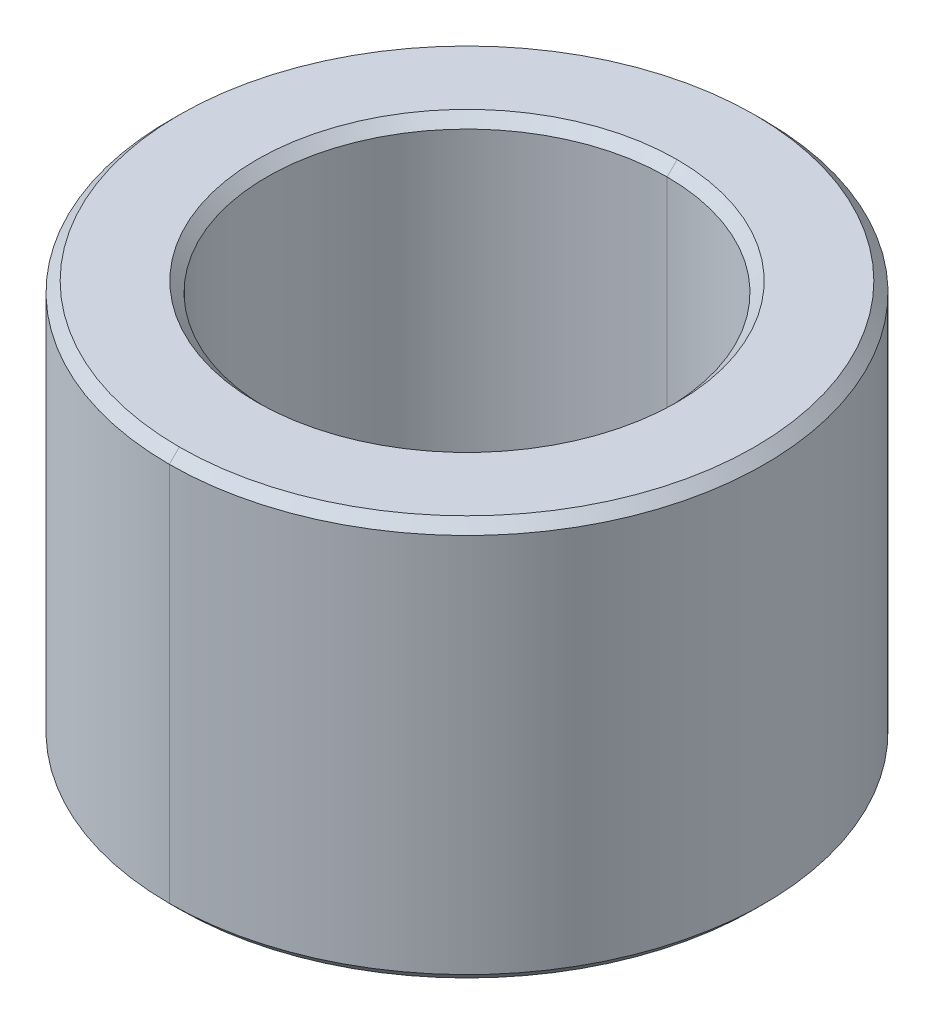
ISO-10303-21;
HEADER;
FILE_DESCRIPTION(('STEP AP214'),'2;1');
FILE_NAME('part.step','',(''),(''),'','','');
FILE_SCHEMA(('AUTOMOTIVE_DESIGN { 1 0 10303 214 1 1 1 1 }'));
ENDSEC;
DATA;
#1=APPLICATION_CONTEXT('core data for automotive mechanical design processes');
#2=APPLICATION_PROTOCOL_DEFINITION('international standard','automotive_design',2000,#1);
#3=PRODUCT_CONTEXT('',#1,'mechanical');
#4=PRODUCT('Part','Part','',(#3));
#5=PRODUCT_RELATED_PRODUCT_CATEGORY('part','',(#4));
#6=PRODUCT_DEFINITION_FORMATION('','',#4);
#7=PRODUCT_DEFINITION_CONTEXT('part definition',#1,'design');
#8=PRODUCT_DEFINITION('design','',#6,#7);
#9=PRODUCT_DEFINITION_SHAPE('','',#8);
#10=(LENGTH_UNIT() NAMED_UNIT(*) SI_UNIT(.MILLI.,.METRE.));
#11=(NAMED_UNIT(*) PLANE_ANGLE_UNIT() SI_UNIT($,.RADIAN.));
#12=(NAMED_UNIT(*) SI_UNIT($,.STERADIAN.) SOLID_ANGLE_UNIT());
#13=UNCERTAINTY_MEASURE_WITH_UNIT(LENGTH_MEASURE(1.E-05),#10,'distance_accuracy_value','');
#14=(GEOMETRIC_REPRESENTATION_CONTEXT(3) GLOBAL_UNCERTAINTY_ASSIGNED_CONTEXT((#13)) GLOBAL_UNIT_ASSIGNED_CONTEXT((#10,
#11,#12)) REPRESENTATION_CONTEXT('',''));
#15=CARTESIAN_POINT('',(0.,0.,0.));
#16=DIRECTION('',(0.,0.,1.));
#17=DIRECTION('',(1.,0.,0.));
#18=AXIS2_PLACEMENT_3D('',#15,#16,#17);
#19=CARTESIAN_POINT('',(0.,1.9,0.));
#20=DIRECTION('',(0.,1.,0.));
#21=DIRECTION('',(0.,0.,1.));
#22=AXIS2_PLACEMENT_3D('',#19,#20,#21);
#23=CONICAL_SURFACE('',#22,2.,0.785398163397455);
#24=DIRECTION('',(0.,0.707106781186543,-0.707106781186552));
#25=VECTOR('',#24,1.);
#26=CARTESIAN_POINT('',(0.,1.9,-2.));
#27=LINE('',#26,#25);
#28=CARTESIAN_POINT('',(0.,1.9,-2.));
#29=VERTEX_POINT('',#28);
#30=CARTESIAN_POINT('',(0.,2.,-2.1));
#31=VERTEX_POINT('',#30);
#32=EDGE_CURVE('E103',#29,#31,#27,.T.);
#33=ORIENTED_EDGE('',*,*,#32,.F.);
#34=CARTESIAN_POINT('',(0.,1.9,0.));
#35=DIRECTION('',(0.,1.,0.));
#36=DIRECTION('',(0.,0.,1.));
#37=AXIS2_PLACEMENT_3D('',#34,#35,#36);
#38=CIRCLE('',#37,2.);
#39=CARTESIAN_POINT('',(0.,1.9,2.));
#40=VERTEX_POINT('',#39);
#41=EDGE_CURVE('E26',#40,#29,#38,.T.);
#42=ORIENTED_EDGE('',*,*,#41,.F.);
#43=DIRECTION('',(0.,0.707106781186543,0.707106781186552));
#44=VECTOR('',#43,1.);
#45=CARTESIAN_POINT('',(0.,1.9,2.));
#46=LINE('',#45,#44);
#47=CARTESIAN_POINT('',(0.,2.,2.1));
#48=VERTEX_POINT('',#47);
#49=EDGE_CURVE('E100',#40,#48,#46,.T.);
#50=ORIENTED_EDGE('',*,*,#49,.T.);
#51=CARTESIAN_POINT('',(0.,2.,0.));
#52=DIRECTION('',(0.,-1.,0.));
#53=DIRECTION('',(0.,0.,1.));
#54=AXIS2_PLACEMENT_3D('',#51,#52,#53);
#55=CIRCLE('',#54,2.1);
#56=EDGE_CURVE('E188',#31,#48,#55,.T.);
#57=ORIENTED_EDGE('',*,*,#56,.F.);
#58=EDGE_LOOP('',(#33,#42,#50,#57));
#59=FACE_BOUND('',#58,.T.);
#60=ADVANCED_FACE('F15',(#59),#23,.F.);
#61=CARTESIAN_POINT('',(0.,-2.,0.));
#62=DIRECTION('',(0.,-1.,0.));
#63=DIRECTION('',(0.,0.,-1.));
#64=AXIS2_PLACEMENT_3D('',#61,#62,#63);
#65=CONICAL_SURFACE('',#64,2.1,0.785398163397443);
#66=DIRECTION('',(0.,-0.707106781186551,0.707106781186545));
#67=VECTOR('',#66,1.);
#68=CARTESIAN_POINT('',(0.,-2.,2.1));
#69=LINE('',#68,#67);
#70=CARTESIAN_POINT('',(0.,-1.9,2.));
#71=VERTEX_POINT('',#70);
#72=CARTESIAN_POINT('',(0.,-2.,2.1));
#73=VERTEX_POINT('',#72);
#74=EDGE_CURVE('E145',#71,#73,#69,.T.);
#75=ORIENTED_EDGE('',*,*,#74,.F.);
#76=CARTESIAN_POINT('',(0.,-1.9,0.));
#77=DIRECTION('',(0.,-1.,0.));
#78=DIRECTION('',(0.,0.,1.));
#79=AXIS2_PLACEMENT_3D('',#76,#77,#78);
#80=CIRCLE('',#79,2.);
#81=CARTESIAN_POINT('',(0.,-1.9,-2.));
#82=VERTEX_POINT('',#81);
#83=EDGE_CURVE('E10',#82,#71,#80,.T.);
#84=ORIENTED_EDGE('',*,*,#83,.F.);
#85=DIRECTION('',(0.,-0.707106781186551,-0.707106781186545));
#86=VECTOR('',#85,1.);
#87=CARTESIAN_POINT('',(0.,-2.,-2.1));
#88=LINE('',#87,#86);
#89=CARTESIAN_POINT('',(0.,-2.,-2.1));
#90=VERTEX_POINT('',#89);
#91=EDGE_CURVE('E144',#82,#90,#88,.T.);
#92=ORIENTED_EDGE('',*,*,#91,.T.);
#93=CARTESIAN_POINT('',(0.,-2.,0.));
#94=DIRECTION('',(0.,1.,0.));
#95=DIRECTION('',(0.,0.,1.));
#96=AXIS2_PLACEMENT_3D('',#93,#94,#95);
#97=CIRCLE('',#96,2.1);
#98=EDGE_CURVE('E149',#73,#90,#97,.T.);
#99=ORIENTED_EDGE('',*,*,#98,.F.);
#100=EDGE_LOOP('',(#75,#84,#92,#99));
#101=FACE_BOUND('',#100,.T.);
#102=ADVANCED_FACE('F276',(#101),#65,.F.);
#103=CARTESIAN_POINT('',(0.,2.,0.));
#104=DIRECTION('',(0.,-1.,0.));
#105=DIRECTION('',(0.,0.,-1.));
#106=AXIS2_PLACEMENT_3D('',#103,#104,#105);
#107=CONICAL_SURFACE('',#106,2.875,0.785398163397452);
#108=DIRECTION('',(0.,-0.707106781186545,0.707106781186551));
#109=VECTOR('',#108,1.);
#110=CARTESIAN_POINT('',(0.,2.,2.875));
#111=LINE('',#110,#109);
#112=CARTESIAN_POINT('',(0.,2.,2.875));
#113=VERTEX_POINT('',#112);
#114=CARTESIAN_POINT('',(0.,1.9,2.975));
#115=VERTEX_POINT('',#114);
#116=EDGE_CURVE('E154',#113,#115,#111,.T.);
#117=ORIENTED_EDGE('',*,*,#116,.F.);
#118=CARTESIAN_POINT('',(0.,2.,0.));
#119=DIRECTION('',(0.,1.,0.));
#120=DIRECTION('',(0.,0.,1.));
#121=AXIS2_PLACEMENT_3D('',#118,#119,#120);
#122=CIRCLE('',#121,2.875);
#123=CARTESIAN_POINT('',(0.,2.,-2.875));
#124=VERTEX_POINT('',#123);
#125=EDGE_CURVE('E19',#124,#113,#122,.T.);
#126=ORIENTED_EDGE('',*,*,#125,.F.);
#127=DIRECTION('',(0.,-0.707106781186545,-0.707106781186551));
#128=VECTOR('',#127,1.);
#129=CARTESIAN_POINT('',(0.,2.,-2.875));
#130=LINE('',#129,#128);
#131=CARTESIAN_POINT('',(0.,1.9,-2.975));
#132=VERTEX_POINT('',#131);
#133=EDGE_CURVE('E153',#124,#132,#130,.T.);
#134=ORIENTED_EDGE('',*,*,#133,.T.);
#135=CARTESIAN_POINT('',(0.,1.9,0.));
#136=DIRECTION('',(0.,-1.,0.));
#137=DIRECTION('',(0.,0.,1.));
#138=AXIS2_PLACEMENT_3D('',#135,#136,#137);
#139=CIRCLE('',#138,2.975);
#140=EDGE_CURVE('E146',#115,#132,#139,.T.);
#141=ORIENTED_EDGE('',*,*,#140,.F.);
#142=EDGE_LOOP('',(#117,#126,#134,#141));
#143=FACE_BOUND('',#142,.T.);
#144=ADVANCED_FACE('F17',(#143),#107,.T.);
#145=CARTESIAN_POINT('',(0.,-1.9,0.));
#146=DIRECTION('',(0.,1.,0.));
#147=DIRECTION('',(0.,0.,1.));
#148=AXIS2_PLACEMENT_3D('',#145,#146,#147);
#149=CONICAL_SURFACE('',#148,2.975,0.78539816339745);
#150=DIRECTION('',(0.,0.707106781186546,-0.707106781186549));
#151=VECTOR('',#150,1.);
#152=CARTESIAN_POINT('',(0.,-1.9,-2.975));
#153=LINE('',#152,#151);
#154=CARTESIAN_POINT('',(0.,-2.,-2.875));
#155=VERTEX_POINT('',#154);
#156=CARTESIAN_POINT('',(0.,-1.9,-2.975));
#157=VERTEX_POINT('',#156);
#158=EDGE_CURVE('E172',#155,#157,#153,.T.);
#159=ORIENTED_EDGE('',*,*,#158,.F.);
#160=CARTESIAN_POINT('',(0.,-2.,0.));
#161=DIRECTION('',(0.,-1.,0.));
#162=DIRECTION('',(0.,0.,1.));
#163=AXIS2_PLACEMENT_3D('',#160,#161,#162);
#164=CIRCLE('',#163,2.875);
#165=CARTESIAN_POINT('',(0.,-2.,2.875));
#166=VERTEX_POINT('',#165);
#167=EDGE_CURVE('E185',#166,#155,#164,.T.);
#168=ORIENTED_EDGE('',*,*,#167,.F.);
#169=DIRECTION('',(0.,0.707106781186546,0.707106781186549));
#170=VECTOR('',#169,1.);
#171=CARTESIAN_POINT('',(0.,-1.9,2.975));
#172=LINE('',#171,#170);
#173=CARTESIAN_POINT('',(0.,-1.9,2.975));
#174=VERTEX_POINT('',#173);
#175=EDGE_CURVE('E119',#166,#174,#172,.T.);
#176=ORIENTED_EDGE('',*,*,#175,.T.);
#177=CARTESIAN_POINT('',(0.,-1.9,0.));
#178=DIRECTION('',(0.,1.,0.));
#179=DIRECTION('',(0.,0.,1.));
#180=AXIS2_PLACEMENT_3D('',#177,#178,#179);
#181=CIRCLE('',#180,2.975);
#182=EDGE_CURVE('E41',#157,#174,#181,.T.);
#183=ORIENTED_EDGE('',*,*,#182,.F.);
#184=EDGE_LOOP('',(#159,#168,#176,#183));
#185=FACE_BOUND('',#184,.T.);
#186=ADVANCED_FACE('F291',(#185),#149,.T.);
#187=CARTESIAN_POINT('',(0.,2.,0.));
#188=DIRECTION('',(0.,-1.,0.));
#189=DIRECTION('',(0.,0.,-1.));
#190=AXIS2_PLACEMENT_3D('',#187,#188,#189);
#191=CYLINDRICAL_SURFACE('',#190,2.);
#192=DIRECTION('',(0.,-1.,0.));
#193=VECTOR('',#192,1.);
#194=CARTESIAN_POINT('',(0.,2.,2.));
#195=LINE('',#194,#193);
#196=EDGE_CURVE('E111',#40,#71,#195,.T.);
#197=ORIENTED_EDGE('',*,*,#196,.F.);
#198=ORIENTED_EDGE('',*,*,#41,.T.);
#199=DIRECTION('',(0.,-1.,0.));
#200=VECTOR('',#199,1.);
#201=CARTESIAN_POINT('',(0.,2.,-2.));
#202=LINE('',#201,#200);
#203=EDGE_CURVE('E118',#29,#82,#202,.T.);
#204=ORIENTED_EDGE('',*,*,#203,.T.);
#205=ORIENTED_EDGE('',*,*,#83,.T.);
#206=EDGE_LOOP('',(#197,#198,#204,#205));
#207=FACE_BOUND('',#206,.T.);
#208=ADVANCED_FACE('F112',(#207),#191,.F.);
#209=CARTESIAN_POINT('',(0.,2.,0.));
#210=DIRECTION('',(0.,-1.,0.));
#211=DIRECTION('',(0.,0.,-1.));
#212=AXIS2_PLACEMENT_3D('',#209,#210,#211);
#213=CYLINDRICAL_SURFACE('',#212,2.975);
#214=DIRECTION('',(0.,-1.,0.));
#215=VECTOR('',#214,1.);
#216=CARTESIAN_POINT('',(0.,2.,2.975));
#217=LINE('',#216,#215);
#218=EDGE_CURVE('E182',#115,#174,#217,.T.);
#219=ORIENTED_EDGE('',*,*,#218,.F.);
#220=ORIENTED_EDGE('',*,*,#140,.T.);
#221=DIRECTION('',(0.,-1.,0.));
#222=VECTOR('',#221,1.);
#223=CARTESIAN_POINT('',(0.,2.,-2.975));
#224=LINE('',#223,#222);
#225=EDGE_CURVE('E169',#132,#157,#224,.T.);
#226=ORIENTED_EDGE('',*,*,#225,.T.);
#227=ORIENTED_EDGE('',*,*,#182,.T.);
#228=EDGE_LOOP('',(#219,#220,#226,#227));
#229=FACE_BOUND('',#228,.T.);
#230=ADVANCED_FACE('F285',(#229),#213,.T.);
#231=CARTESIAN_POINT('',(0.,-2.,0.));
#232=DIRECTION('',(0.,1.,0.));
#233=DIRECTION('',(1.,0.,0.));
#234=AXIS2_PLACEMENT_3D('',#231,#232,#233);
#235=PLANE('',#234);
#236=CARTESIAN_POINT('',(0.,-2.,0.));
#237=DIRECTION('',(0.,1.,0.));
#238=DIRECTION('',(0.,0.,1.));
#239=AXIS2_PLACEMENT_3D('',#236,#237,#238);
#240=CIRCLE('',#239,2.1);
#241=EDGE_CURVE('E140',#90,#73,#240,.T.);
#242=ORIENTED_EDGE('',*,*,#241,.T.);
#243=ORIENTED_EDGE('',*,*,#98,.T.);
#244=EDGE_LOOP('',(#242,#243));
#245=FACE_BOUND('',#244,.T.);
#246=ORIENTED_EDGE('',*,*,#167,.T.);
#247=CARTESIAN_POINT('',(0.,-2.,0.));
#248=DIRECTION('',(0.,-1.,0.));
#249=DIRECTION('',(0.,0.,1.));
#250=AXIS2_PLACEMENT_3D('',#247,#248,#249);
#251=CIRCLE('',#250,2.875);
#252=EDGE_CURVE('E177',#155,#166,#251,.T.);
#253=ORIENTED_EDGE('',*,*,#252,.T.);
#254=EDGE_LOOP('',(#246,#253));
#255=FACE_BOUND('',#254,.T.);
#256=ADVANCED_FACE('F281',(#245,#255),#235,.F.);
#257=CARTESIAN_POINT('',(0.,2.,0.));
#258=DIRECTION('',(0.,1.,0.));
#259=DIRECTION('',(1.,0.,0.));
#260=AXIS2_PLACEMENT_3D('',#257,#258,#259);
#261=PLANE('',#260);
#262=CARTESIAN_POINT('',(0.,2.,0.));
#263=DIRECTION('',(0.,-1.,0.));
#264=DIRECTION('',(0.,0.,1.));
#265=AXIS2_PLACEMENT_3D('',#262,#263,#264);
#266=CIRCLE('',#265,2.1);
#267=EDGE_CURVE('E125',#48,#31,#266,.T.);
#268=ORIENTED_EDGE('',*,*,#267,.T.);
#269=ORIENTED_EDGE('',*,*,#56,.T.);
#270=EDGE_LOOP('',(#268,#269));
#271=FACE_BOUND('',#270,.T.);
#272=ORIENTED_EDGE('',*,*,#125,.T.);
#273=CARTESIAN_POINT('',(0.,2.,0.));
#274=DIRECTION('',(0.,1.,0.));
#275=DIRECTION('',(0.,0.,1.));
#276=AXIS2_PLACEMENT_3D('',#273,#274,#275);
#277=CIRCLE('',#276,2.875);
#278=EDGE_CURVE('E178',#113,#124,#277,.T.);
#279=ORIENTED_EDGE('',*,*,#278,.T.);
#280=EDGE_LOOP('',(#272,#279));
#281=FACE_BOUND('',#280,.T.);
#282=ADVANCED_FACE('F198',(#271,#281),#261,.T.);
#283=CARTESIAN_POINT('',(0.,2.,0.));
#284=DIRECTION('',(0.,-1.,0.));
#285=DIRECTION('',(0.,0.,-1.));
#286=AXIS2_PLACEMENT_3D('',#283,#284,#285);
#287=CYLINDRICAL_SURFACE('',#286,2.975);
#288=CARTESIAN_POINT('',(0.,1.9,0.));
#289=DIRECTION('',(0.,-1.,0.));
#290=DIRECTION('',(0.,0.,1.));
#291=AXIS2_PLACEMENT_3D('',#288,#289,#290);
#292=CIRCLE('',#291,2.975);
#293=EDGE_CURVE('E150',#132,#115,#292,.T.);
#294=ORIENTED_EDGE('',*,*,#293,.T.);
#295=ORIENTED_EDGE('',*,*,#218,.T.);
#296=CARTESIAN_POINT('',(0.,-1.9,0.));
#297=DIRECTION('',(0.,1.,0.));
#298=DIRECTION('',(0.,0.,1.));
#299=AXIS2_PLACEMENT_3D('',#296,#297,#298);
#300=CIRCLE('',#299,2.975);
#301=EDGE_CURVE('E176',#174,#157,#300,.T.);
#302=ORIENTED_EDGE('',*,*,#301,.T.);
#303=ORIENTED_EDGE('',*,*,#225,.F.);
#304=EDGE_LOOP('',(#294,#295,#302,#303));
#305=FACE_BOUND('',#304,.T.);
#306=ADVANCED_FACE('F310',(#305),#287,.T.);
#307=CARTESIAN_POINT('',(0.,2.,0.));
#308=DIRECTION('',(0.,-1.,0.));
#309=DIRECTION('',(0.,0.,-1.));
#310=AXIS2_PLACEMENT_3D('',#307,#308,#309);
#311=CYLINDRICAL_SURFACE('',#310,2.);
#312=CARTESIAN_POINT('',(0.,1.9,0.));
#313=DIRECTION('',(0.,1.,0.));
#314=DIRECTION('',(0.,0.,1.));
#315=AXIS2_PLACEMENT_3D('',#312,#313,#314);
#316=CIRCLE('',#315,2.);
#317=EDGE_CURVE('E123',#29,#40,#316,.T.);
#318=ORIENTED_EDGE('',*,*,#317,.T.);
#319=ORIENTED_EDGE('',*,*,#196,.T.);
#320=CARTESIAN_POINT('',(0.,-1.9,0.));
#321=DIRECTION('',(0.,-1.,0.));
#322=DIRECTION('',(0.,0.,1.));
#323=AXIS2_PLACEMENT_3D('',#320,#321,#322);
#324=CIRCLE('',#323,2.);
#325=EDGE_CURVE('E127',#71,#82,#324,.T.);
#326=ORIENTED_EDGE('',*,*,#325,.T.);
#327=ORIENTED_EDGE('',*,*,#203,.F.);
#328=EDGE_LOOP('',(#318,#319,#326,#327));
#329=FACE_BOUND('',#328,.T.);
#330=ADVANCED_FACE('F129',(#329),#311,.F.);
#331=CARTESIAN_POINT('',(0.,-1.9,0.));
#332=DIRECTION('',(0.,1.,0.));
#333=DIRECTION('',(0.,0.,1.));
#334=AXIS2_PLACEMENT_3D('',#331,#332,#333);
#335=CONICAL_SURFACE('',#334,2.975,0.78539816339745);
#336=ORIENTED_EDGE('',*,*,#252,.F.);
#337=ORIENTED_EDGE('',*,*,#158,.T.);
#338=ORIENTED_EDGE('',*,*,#301,.F.);
#339=ORIENTED_EDGE('',*,*,#175,.F.);
#340=EDGE_LOOP('',(#336,#337,#338,#339));
#341=FACE_BOUND('',#340,.T.);
#342=ADVANCED_FACE('F334',(#341),#335,.T.);
#343=CARTESIAN_POINT('',(0.,2.,0.));
#344=DIRECTION('',(0.,-1.,0.));
#345=DIRECTION('',(0.,0.,-1.));
#346=AXIS2_PLACEMENT_3D('',#343,#344,#345);
#347=CONICAL_SURFACE('',#346,2.875,0.785398163397452);
#348=ORIENTED_EDGE('',*,*,#278,.F.);
#349=ORIENTED_EDGE('',*,*,#116,.T.);
#350=ORIENTED_EDGE('',*,*,#293,.F.);
#351=ORIENTED_EDGE('',*,*,#133,.F.);
#352=EDGE_LOOP('',(#348,#349,#350,#351));
#353=FACE_BOUND('',#352,.T.);
#354=ADVANCED_FACE('F326',(#353),#347,.T.);
#355=CARTESIAN_POINT('',(0.,-2.,0.));
#356=DIRECTION('',(0.,-1.,0.));
#357=DIRECTION('',(0.,0.,-1.));
#358=AXIS2_PLACEMENT_3D('',#355,#356,#357);
#359=CONICAL_SURFACE('',#358,2.1,0.785398163397443);
#360=ORIENTED_EDGE('',*,*,#325,.F.);
#361=ORIENTED_EDGE('',*,*,#74,.T.);
#362=ORIENTED_EDGE('',*,*,#241,.F.);
#363=ORIENTED_EDGE('',*,*,#91,.F.);
#364=EDGE_LOOP('',(#360,#361,#362,#363));
#365=FACE_BOUND('',#364,.T.);
#366=ADVANCED_FACE('F318',(#365),#359,.F.);
#367=CARTESIAN_POINT('',(0.,1.9,0.));
#368=DIRECTION('',(0.,1.,0.));
#369=DIRECTION('',(0.,0.,1.));
#370=AXIS2_PLACEMENT_3D('',#367,#368,#369);
#371=CONICAL_SURFACE('',#370,2.,0.785398163397455);
#372=ORIENTED_EDGE('',*,*,#317,.F.);
#373=ORIENTED_EDGE('',*,*,#32,.T.);
#374=ORIENTED_EDGE('',*,*,#267,.F.);
#375=ORIENTED_EDGE('',*,*,#49,.F.);
#376=EDGE_LOOP('',(#372,#373,#374,#375));
#377=FACE_BOUND('',#376,.T.);
#378=ADVANCED_FACE('F122',(#377),#371,.F.);
#379=CLOSED_SHELL('',(#60,#102,#144,#186,#208,#230,#256,#282,#306,#330,#342,#354,#366,#378));
#380=MANIFOLD_SOLID_BREP('B1',#379);
#381=ADVANCED_BREP_SHAPE_REPRESENTATION('',(#18,#380),#14);
#382=SHAPE_DEFINITION_REPRESENTATION(#9,#381);
ENDSEC;
END-ISO-10303-21;
